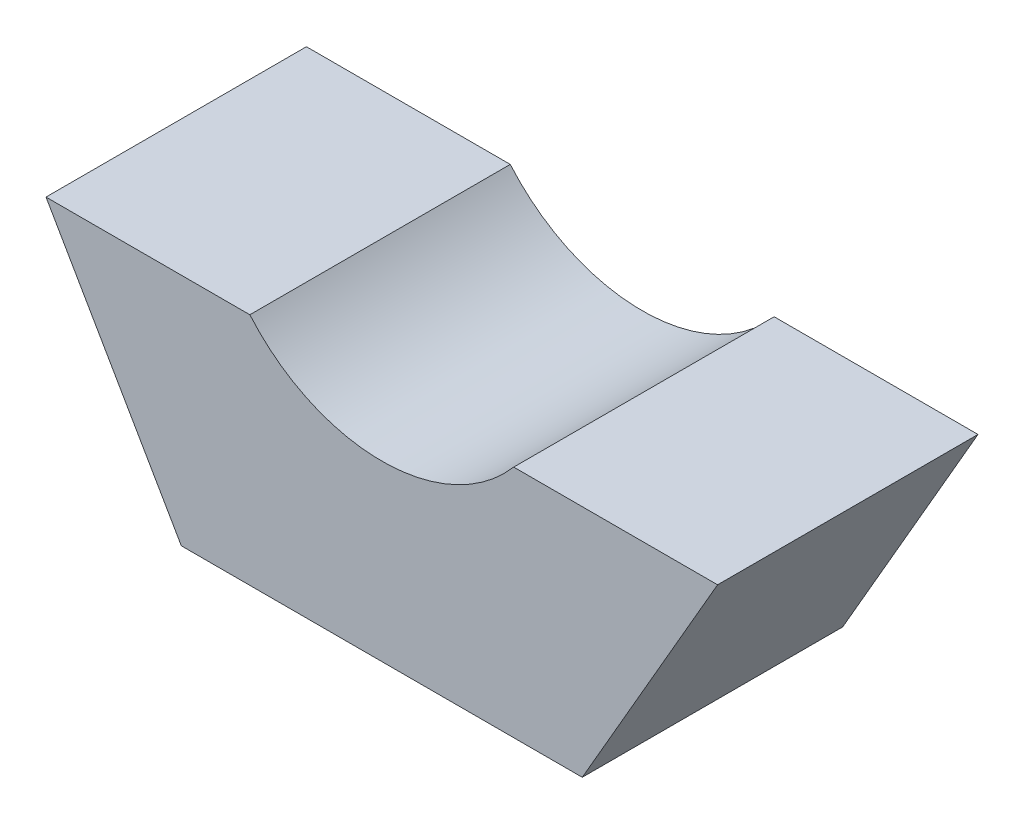
ISO-10303-21;
HEADER;
FILE_DESCRIPTION(('STEP AP214'),'2;1');
FILE_NAME('part.step','',(''),(''),'','','');
FILE_SCHEMA(('AUTOMOTIVE_DESIGN { 1 0 10303 214 1 1 1 1 }'));
ENDSEC;
DATA;
#1=APPLICATION_CONTEXT('core data for automotive mechanical design processes');
#2=APPLICATION_PROTOCOL_DEFINITION('international standard','automotive_design',2000,#1);
#3=PRODUCT_CONTEXT('',#1,'mechanical');
#4=PRODUCT('Part','Part','',(#3));
#5=PRODUCT_RELATED_PRODUCT_CATEGORY('part','',(#4));
#6=PRODUCT_DEFINITION_FORMATION('','',#4);
#7=PRODUCT_DEFINITION_CONTEXT('part definition',#1,'design');
#8=PRODUCT_DEFINITION('design','',#6,#7);
#9=PRODUCT_DEFINITION_SHAPE('','',#8);
#10=(LENGTH_UNIT() NAMED_UNIT(*) SI_UNIT(.MILLI.,.METRE.));
#11=(NAMED_UNIT(*) PLANE_ANGLE_UNIT() SI_UNIT($,.RADIAN.));
#12=(NAMED_UNIT(*) SI_UNIT($,.STERADIAN.) SOLID_ANGLE_UNIT());
#13=UNCERTAINTY_MEASURE_WITH_UNIT(LENGTH_MEASURE(1.E-05),#10,'distance_accuracy_value','');
#14=(GEOMETRIC_REPRESENTATION_CONTEXT(3) GLOBAL_UNCERTAINTY_ASSIGNED_CONTEXT((#13)) GLOBAL_UNIT_ASSIGNED_CONTEXT((#10,
#11,#12)) REPRESENTATION_CONTEXT('',''));
#15=CARTESIAN_POINT('',(0.,0.,0.));
#16=DIRECTION('',(0.,0.,1.));
#17=DIRECTION('',(1.,0.,0.));
#18=AXIS2_PLACEMENT_3D('',#15,#16,#17);
#19=CARTESIAN_POINT('',(0.,0.,30.));
#20=DIRECTION('',(0.,0.,1.));
#21=DIRECTION('',(1.,0.,0.));
#22=AXIS2_PLACEMENT_3D('',#19,#20,#21);
#23=PLANE('',#22);
#24=DIRECTION('',(1.,0.,0.));
#25=VECTOR('',#24,1.);
#26=CARTESIAN_POINT('',(44.4559707276012,-13.,30.));
#27=LINE('',#26,#25);
#28=CARTESIAN_POINT('',(-38.682468035705,-13.,30.));
#29=VERTEX_POINT('',#28);
#30=CARTESIAN_POINT('',(-15.1986841535706,-13.,30.));
#31=VERTEX_POINT('',#30);
#32=EDGE_CURVE('E84',#29,#31,#27,.T.);
#33=ORIENTED_EDGE('',*,*,#32,.F.);
#34=DIRECTION('',(0.5,-0.866025403784438,0.));
#35=VECTOR('',#34,1.);
#36=CARTESIAN_POINT('',(-46.1880215351701,0.,30.));
#37=LINE('',#36,#35);
#38=CARTESIAN_POINT('',(-23.0940107675851,-40.,30.));
#39=VERTEX_POINT('',#38);
#40=EDGE_CURVE('E91',#29,#39,#37,.T.);
#41=ORIENTED_EDGE('',*,*,#40,.T.);
#42=DIRECTION('',(1.,0.,0.));
#43=VECTOR('',#42,1.);
#44=CARTESIAN_POINT('',(-23.0940107675851,-40.,30.));
#45=LINE('',#44,#43);
#46=CARTESIAN_POINT('',(23.094010767585,-40.,30.));
#47=VERTEX_POINT('',#46);
#48=EDGE_CURVE('E100',#39,#47,#45,.T.);
#49=ORIENTED_EDGE('',*,*,#48,.T.);
#50=DIRECTION('',(0.5,0.866025403784439,0.));
#51=VECTOR('',#50,1.);
#52=CARTESIAN_POINT('',(23.094010767585,-40.,30.));
#53=LINE('',#52,#51);
#54=CARTESIAN_POINT('',(38.6824680357049,-13.,30.));
#55=VERTEX_POINT('',#54);
#56=EDGE_CURVE('E101',#47,#55,#53,.T.);
#57=ORIENTED_EDGE('',*,*,#56,.T.);
#58=CARTESIAN_POINT('',(15.1986841535706,-13.,30.));
#59=VERTEX_POINT('',#58);
#60=EDGE_CURVE('E48',#59,#55,#27,.T.);
#61=ORIENTED_EDGE('',*,*,#60,.F.);
#62=CARTESIAN_POINT('',(0.,0.,30.));
#63=DIRECTION('',(0.,0.,1.));
#64=DIRECTION('',(1.,0.,0.));
#65=AXIS2_PLACEMENT_3D('',#62,#63,#64);
#66=CIRCLE('',#65,20.);
#67=EDGE_CURVE('E94',#31,#59,#66,.T.);
#68=ORIENTED_EDGE('',*,*,#67,.F.);
#69=EDGE_LOOP('',(#33,#41,#49,#57,#61,#68));
#70=FACE_BOUND('',#69,.T.);
#71=ADVANCED_FACE('F33',(#70),#23,.T.);
#72=CARTESIAN_POINT('',(0.,0.,0.));
#73=DIRECTION('',(0.,0.,1.));
#74=DIRECTION('',(1.,0.,0.));
#75=AXIS2_PLACEMENT_3D('',#72,#73,#74);
#76=PLANE('',#75);
#77=DIRECTION('',(0.5,-0.866025403784438,0.));
#78=VECTOR('',#77,1.);
#79=CARTESIAN_POINT('',(-46.1880215351701,0.,0.));
#80=LINE('',#79,#78);
#81=CARTESIAN_POINT('',(-38.682468035705,-13.,0.));
#82=VERTEX_POINT('',#81);
#83=CARTESIAN_POINT('',(-23.0940107675851,-40.,0.));
#84=VERTEX_POINT('',#83);
#85=EDGE_CURVE('E113',#82,#84,#80,.T.);
#86=ORIENTED_EDGE('',*,*,#85,.F.);
#87=DIRECTION('',(1.,0.,0.));
#88=VECTOR('',#87,1.);
#89=CARTESIAN_POINT('',(44.4559707276012,-13.,0.));
#90=LINE('',#89,#88);
#91=CARTESIAN_POINT('',(-15.1986841535706,-13.,0.));
#92=VERTEX_POINT('',#91);
#93=EDGE_CURVE('E56',#82,#92,#90,.T.);
#94=ORIENTED_EDGE('',*,*,#93,.T.);
#95=CARTESIAN_POINT('',(0.,0.,0.));
#96=DIRECTION('',(0.,0.,1.));
#97=DIRECTION('',(1.,0.,0.));
#98=AXIS2_PLACEMENT_3D('',#95,#96,#97);
#99=CIRCLE('',#98,20.);
#100=CARTESIAN_POINT('',(15.1986841535706,-13.,0.));
#101=VERTEX_POINT('',#100);
#102=EDGE_CURVE('E135',#92,#101,#99,.T.);
#103=ORIENTED_EDGE('',*,*,#102,.T.);
#104=CARTESIAN_POINT('',(38.6824680357049,-13.,0.));
#105=VERTEX_POINT('',#104);
#106=EDGE_CURVE('E95',#101,#105,#90,.T.);
#107=ORIENTED_EDGE('',*,*,#106,.T.);
#108=DIRECTION('',(0.5,0.866025403784439,0.));
#109=VECTOR('',#108,1.);
#110=CARTESIAN_POINT('',(23.094010767585,-40.,0.));
#111=LINE('',#110,#109);
#112=CARTESIAN_POINT('',(23.094010767585,-40.,0.));
#113=VERTEX_POINT('',#112);
#114=EDGE_CURVE('E110',#113,#105,#111,.T.);
#115=ORIENTED_EDGE('',*,*,#114,.F.);
#116=DIRECTION('',(1.,0.,0.));
#117=VECTOR('',#116,1.);
#118=CARTESIAN_POINT('',(-23.0940107675851,-40.,0.));
#119=LINE('',#118,#117);
#120=EDGE_CURVE('E106',#84,#113,#119,.T.);
#121=ORIENTED_EDGE('',*,*,#120,.F.);
#122=EDGE_LOOP('',(#86,#94,#103,#107,#115,#121));
#123=FACE_BOUND('',#122,.T.);
#124=ADVANCED_FACE('F123',(#123),#76,.F.);
#125=CARTESIAN_POINT('',(0.,0.,30.));
#126=DIRECTION('',(0.,0.,-1.));
#127=DIRECTION('',(-1.,0.,0.));
#128=AXIS2_PLACEMENT_3D('',#125,#126,#127);
#129=CYLINDRICAL_SURFACE('',#128,20.);
#130=DIRECTION('',(0.,0.,-1.));
#131=VECTOR('',#130,1.);
#132=CARTESIAN_POINT('',(-15.1986841535706,-13.,30.));
#133=LINE('',#132,#131);
#134=EDGE_CURVE('E134',#31,#92,#133,.T.);
#135=ORIENTED_EDGE('',*,*,#134,.F.);
#136=ORIENTED_EDGE('',*,*,#67,.T.);
#137=DIRECTION('',(0.,0.,-1.));
#138=VECTOR('',#137,1.);
#139=CARTESIAN_POINT('',(15.1986841535706,-13.,30.));
#140=LINE('',#139,#138);
#141=EDGE_CURVE('E133',#101,#59,#140,.F.);
#142=ORIENTED_EDGE('',*,*,#141,.F.);
#143=ORIENTED_EDGE('',*,*,#102,.F.);
#144=EDGE_LOOP('',(#135,#136,#142,#143));
#145=FACE_BOUND('',#144,.T.);
#146=ADVANCED_FACE('F131',(#145),#129,.F.);
#147=CARTESIAN_POINT('',(23.094010767585,-40.,30.));
#148=DIRECTION('',(-0.866025403784439,0.5,0.));
#149=DIRECTION('',(-0.5,-0.866025403784439,0.));
#150=AXIS2_PLACEMENT_3D('',#147,#148,#149);
#151=PLANE('',#150);
#152=ORIENTED_EDGE('',*,*,#114,.T.);
#153=DIRECTION('',(0.,0.,1.));
#154=VECTOR('',#153,1.);
#155=CARTESIAN_POINT('',(38.6824680357049,-13.,30.));
#156=LINE('',#155,#154);
#157=EDGE_CURVE('E128',#105,#55,#156,.T.);
#158=ORIENTED_EDGE('',*,*,#157,.T.);
#159=ORIENTED_EDGE('',*,*,#56,.F.);
#160=DIRECTION('',(0.,0.,-1.));
#161=VECTOR('',#160,1.);
#162=CARTESIAN_POINT('',(23.094010767585,-40.,30.));
#163=LINE('',#162,#161);
#164=EDGE_CURVE('E103',#47,#113,#163,.T.);
#165=ORIENTED_EDGE('',*,*,#164,.T.);
#166=EDGE_LOOP('',(#152,#158,#159,#165));
#167=FACE_BOUND('',#166,.T.);
#168=ADVANCED_FACE('F35',(#167),#151,.F.);
#169=CARTESIAN_POINT('',(-46.1880215351701,0.,30.));
#170=DIRECTION('',(0.866025403784439,0.5,0.));
#171=DIRECTION('',(-0.5,0.866025403784439,0.));
#172=AXIS2_PLACEMENT_3D('',#169,#170,#171);
#173=PLANE('',#172);
#174=ORIENTED_EDGE('',*,*,#40,.F.);
#175=DIRECTION('',(0.,0.,-1.));
#176=VECTOR('',#175,1.);
#177=CARTESIAN_POINT('',(-38.682468035705,-13.,30.));
#178=LINE('',#177,#176);
#179=EDGE_CURVE('E11',#29,#82,#178,.T.);
#180=ORIENTED_EDGE('',*,*,#179,.T.);
#181=ORIENTED_EDGE('',*,*,#85,.T.);
#182=DIRECTION('',(0.,0.,-1.));
#183=VECTOR('',#182,1.);
#184=CARTESIAN_POINT('',(-23.0940107675851,-40.,30.));
#185=LINE('',#184,#183);
#186=EDGE_CURVE('E41',#39,#84,#185,.T.);
#187=ORIENTED_EDGE('',*,*,#186,.F.);
#188=EDGE_LOOP('',(#174,#180,#181,#187));
#189=FACE_BOUND('',#188,.T.);
#190=ADVANCED_FACE('F97',(#189),#173,.F.);
#191=CARTESIAN_POINT('',(-23.0940107675851,-40.,30.));
#192=DIRECTION('',(0.,1.,0.));
#193=DIRECTION('',(-1.,0.,0.));
#194=AXIS2_PLACEMENT_3D('',#191,#192,#193);
#195=PLANE('',#194);
#196=ORIENTED_EDGE('',*,*,#120,.T.);
#197=ORIENTED_EDGE('',*,*,#164,.F.);
#198=ORIENTED_EDGE('',*,*,#48,.F.);
#199=ORIENTED_EDGE('',*,*,#186,.T.);
#200=EDGE_LOOP('',(#196,#197,#198,#199));
#201=FACE_BOUND('',#200,.T.);
#202=ADVANCED_FACE('F119',(#201),#195,.F.);
#203=CARTESIAN_POINT('',(44.4559707276012,-13.,0.));
#204=DIRECTION('',(0.,-1.,0.));
#205=DIRECTION('',(1.,0.,0.));
#206=AXIS2_PLACEMENT_3D('',#203,#204,#205);
#207=PLANE('',#206);
#208=ORIENTED_EDGE('',*,*,#134,.T.);
#209=ORIENTED_EDGE('',*,*,#93,.F.);
#210=ORIENTED_EDGE('',*,*,#179,.F.);
#211=ORIENTED_EDGE('',*,*,#32,.T.);
#212=EDGE_LOOP('',(#208,#209,#210,#211));
#213=FACE_BOUND('',#212,.T.);
#214=ADVANCED_FACE('F83',(#213),#207,.F.);
#215=ORIENTED_EDGE('',*,*,#141,.T.);
#216=ORIENTED_EDGE('',*,*,#60,.T.);
#217=ORIENTED_EDGE('',*,*,#157,.F.);
#218=ORIENTED_EDGE('',*,*,#106,.F.);
#219=EDGE_LOOP('',(#215,#216,#217,#218));
#220=FACE_BOUND('',#219,.T.);
#221=ADVANCED_FACE('F141',(#220),#207,.F.);
#222=CLOSED_SHELL('',(#71,#124,#146,#168,#190,#202,#214,#221));
#223=MANIFOLD_SOLID_BREP('B2',#222);
#224=ADVANCED_BREP_SHAPE_REPRESENTATION('',(#18,#223),#14);
#225=SHAPE_DEFINITION_REPRESENTATION(#9,#224);
ENDSEC;
END-ISO-10303-21;
